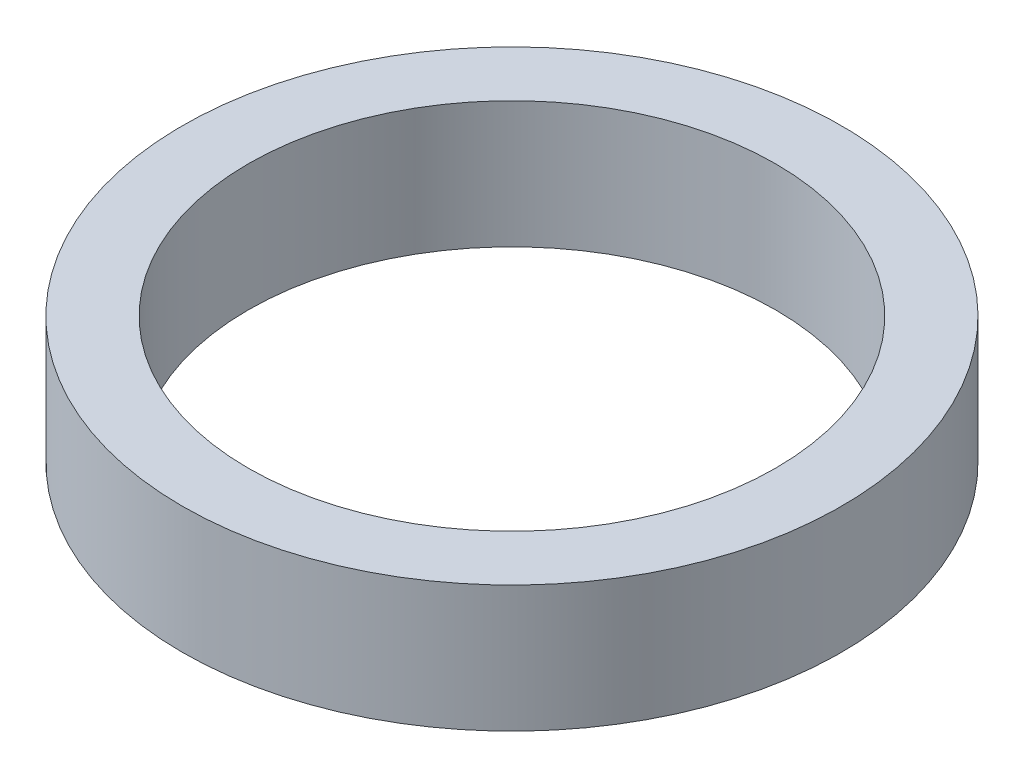
ISO-10303-21;
HEADER;
FILE_DESCRIPTION(('STEP AP214'),'2;1');
FILE_NAME('part.step','',(''),(''),'','','');
FILE_SCHEMA(('AUTOMOTIVE_DESIGN { 1 0 10303 214 1 1 1 1 }'));
ENDSEC;
DATA;
#1=APPLICATION_CONTEXT('core data for automotive mechanical design processes');
#2=APPLICATION_PROTOCOL_DEFINITION('international standard','automotive_design',2000,#1);
#3=PRODUCT_CONTEXT('',#1,'mechanical');
#4=PRODUCT('Part','Part','',(#3));
#5=PRODUCT_RELATED_PRODUCT_CATEGORY('part','',(#4));
#6=PRODUCT_DEFINITION_FORMATION('','',#4);
#7=PRODUCT_DEFINITION_CONTEXT('part definition',#1,'design');
#8=PRODUCT_DEFINITION('design','',#6,#7);
#9=PRODUCT_DEFINITION_SHAPE('','',#8);
#10=(LENGTH_UNIT() NAMED_UNIT(*) SI_UNIT(.MILLI.,.METRE.));
#11=(NAMED_UNIT(*) PLANE_ANGLE_UNIT() SI_UNIT($,.RADIAN.));
#12=(NAMED_UNIT(*) SI_UNIT($,.STERADIAN.) SOLID_ANGLE_UNIT());
#13=UNCERTAINTY_MEASURE_WITH_UNIT(LENGTH_MEASURE(1.E-05),#10,'distance_accuracy_value','');
#14=(GEOMETRIC_REPRESENTATION_CONTEXT(3) GLOBAL_UNCERTAINTY_ASSIGNED_CONTEXT((#13)) GLOBAL_UNIT_ASSIGNED_CONTEXT((#10,
#11,#12)) REPRESENTATION_CONTEXT('',''));
#15=CARTESIAN_POINT('',(0.,0.,0.));
#16=DIRECTION('',(0.,0.,1.));
#17=DIRECTION('',(1.,0.,0.));
#18=AXIS2_PLACEMENT_3D('',#15,#16,#17);
#19=CARTESIAN_POINT('',(0.,24.,0.));
#20=DIRECTION('',(0.,-1.,0.));
#21=DIRECTION('',(0.,0.,-1.));
#22=AXIS2_PLACEMENT_3D('',#19,#20,#21);
#23=CYLINDRICAL_SURFACE('',#22,62.5);
#24=CARTESIAN_POINT('',(0.,24.,0.));
#25=DIRECTION('',(0.,1.,0.));
#26=DIRECTION('',(0.,0.,1.));
#27=AXIS2_PLACEMENT_3D('',#24,#25,#26);
#28=CIRCLE('',#27,62.5);
#29=CARTESIAN_POINT('',(0.,24.,62.5));
#30=VERTEX_POINT('',#29);
#31=EDGE_CURVE('E10',#30,#30,#28,.T.);
#32=ORIENTED_EDGE('',*,*,#31,.F.);
#33=EDGE_LOOP('',(#32));
#34=FACE_BOUND('',#33,.T.);
#35=CARTESIAN_POINT('',(0.,0.,0.));
#36=DIRECTION('',(0.,1.,0.));
#37=DIRECTION('',(0.,0.,1.));
#38=AXIS2_PLACEMENT_3D('',#35,#36,#37);
#39=CIRCLE('',#38,62.5);
#40=CARTESIAN_POINT('',(0.,0.,62.5));
#41=VERTEX_POINT('',#40);
#42=EDGE_CURVE('E37',#41,#41,#39,.T.);
#43=ORIENTED_EDGE('',*,*,#42,.T.);
#44=EDGE_LOOP('',(#43));
#45=FACE_BOUND('',#44,.T.);
#46=ADVANCED_FACE('F40',(#34,#45),#23,.T.);
#47=CARTESIAN_POINT('',(0.,24.,0.));
#48=DIRECTION('',(0.,1.,0.));
#49=DIRECTION('',(0.,0.,1.));
#50=AXIS2_PLACEMENT_3D('',#47,#48,#49);
#51=PLANE('',#50);
#52=CARTESIAN_POINT('',(0.,24.,0.));
#53=DIRECTION('',(0.,1.,0.));
#54=DIRECTION('',(0.,0.,1.));
#55=AXIS2_PLACEMENT_3D('',#52,#53,#54);
#56=CIRCLE('',#55,50.);
#57=CARTESIAN_POINT('',(0.,24.,50.));
#58=VERTEX_POINT('',#57);
#59=EDGE_CURVE('E50',#58,#58,#56,.T.);
#60=ORIENTED_EDGE('',*,*,#59,.F.);
#61=EDGE_LOOP('',(#60));
#62=FACE_BOUND('',#61,.T.);
#63=ORIENTED_EDGE('',*,*,#31,.T.);
#64=EDGE_LOOP('',(#63));
#65=FACE_BOUND('',#64,.T.);
#66=ADVANCED_FACE('F59',(#62,#65),#51,.T.);
#67=CARTESIAN_POINT('',(0.,0.,0.));
#68=DIRECTION('',(0.,1.,0.));
#69=DIRECTION('',(0.,0.,1.));
#70=AXIS2_PLACEMENT_3D('',#67,#68,#69);
#71=PLANE('',#70);
#72=CARTESIAN_POINT('',(0.,0.,0.));
#73=DIRECTION('',(0.,1.,0.));
#74=DIRECTION('',(0.,0.,1.));
#75=AXIS2_PLACEMENT_3D('',#72,#73,#74);
#76=CIRCLE('',#75,50.);
#77=CARTESIAN_POINT('',(0.,0.,50.));
#78=VERTEX_POINT('',#77);
#79=EDGE_CURVE('E47',#78,#78,#76,.T.);
#80=ORIENTED_EDGE('',*,*,#79,.T.);
#81=EDGE_LOOP('',(#80));
#82=FACE_BOUND('',#81,.T.);
#83=ORIENTED_EDGE('',*,*,#42,.F.);
#84=EDGE_LOOP('',(#83));
#85=FACE_BOUND('',#84,.T.);
#86=ADVANCED_FACE('F58',(#82,#85),#71,.F.);
#87=CARTESIAN_POINT('',(0.,24.,0.));
#88=DIRECTION('',(0.,-1.,0.));
#89=DIRECTION('',(0.,0.,-1.));
#90=AXIS2_PLACEMENT_3D('',#87,#88,#89);
#91=CYLINDRICAL_SURFACE('',#90,50.);
#92=ORIENTED_EDGE('',*,*,#59,.T.);
#93=EDGE_LOOP('',(#92));
#94=FACE_BOUND('',#93,.T.);
#95=ORIENTED_EDGE('',*,*,#79,.F.);
#96=EDGE_LOOP('',(#95));
#97=FACE_BOUND('',#96,.T.);
#98=ADVANCED_FACE('F54',(#94,#97),#91,.F.);
#99=CLOSED_SHELL('',(#46,#66,#86,#98));
#100=MANIFOLD_SOLID_BREP('B2',#99);
#101=ADVANCED_BREP_SHAPE_REPRESENTATION('',(#18,#100),#14);
#102=SHAPE_DEFINITION_REPRESENTATION(#9,#101);
ENDSEC;
END-ISO-10303-21;
